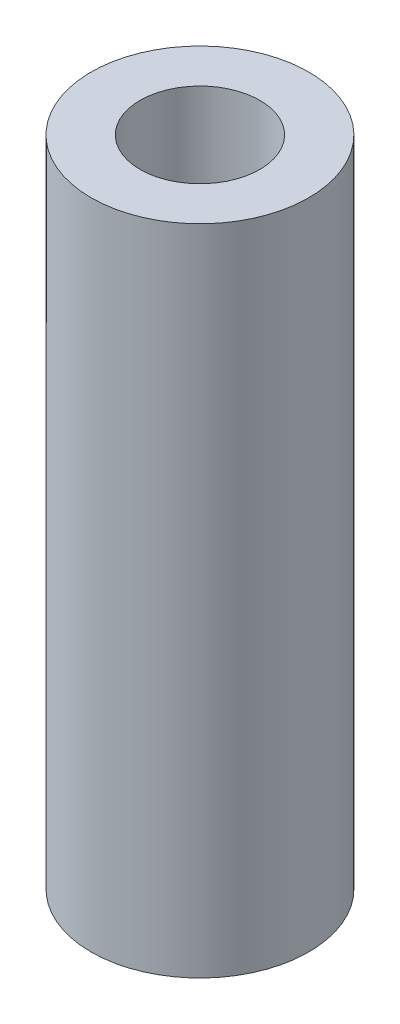
ISO-10303-21;
HEADER;
FILE_DESCRIPTION(('STEP AP214'),'2;1');
FILE_NAME('part.step','',(''),(''),'','','');
FILE_SCHEMA(('AUTOMOTIVE_DESIGN { 1 0 10303 214 1 1 1 1 }'));
ENDSEC;
DATA;
#1=APPLICATION_CONTEXT('core data for automotive mechanical design processes');
#2=APPLICATION_PROTOCOL_DEFINITION('international standard','automotive_design',2000,#1);
#3=PRODUCT_CONTEXT('',#1,'mechanical');
#4=PRODUCT('Part','Part','',(#3));
#5=PRODUCT_RELATED_PRODUCT_CATEGORY('part','',(#4));
#6=PRODUCT_DEFINITION_FORMATION('','',#4);
#7=PRODUCT_DEFINITION_CONTEXT('part definition',#1,'design');
#8=PRODUCT_DEFINITION('design','',#6,#7);
#9=PRODUCT_DEFINITION_SHAPE('','',#8);
#10=(LENGTH_UNIT() NAMED_UNIT(*) SI_UNIT(.MILLI.,.METRE.));
#11=(NAMED_UNIT(*) PLANE_ANGLE_UNIT() SI_UNIT($,.RADIAN.));
#12=(NAMED_UNIT(*) SI_UNIT($,.STERADIAN.) SOLID_ANGLE_UNIT());
#13=UNCERTAINTY_MEASURE_WITH_UNIT(LENGTH_MEASURE(1.E-05),#10,'distance_accuracy_value','');
#14=(GEOMETRIC_REPRESENTATION_CONTEXT(3) GLOBAL_UNCERTAINTY_ASSIGNED_CONTEXT((#13)) GLOBAL_UNIT_ASSIGNED_CONTEXT((#10,
#11,#12)) REPRESENTATION_CONTEXT('',''));
#15=CARTESIAN_POINT('',(0.,0.,0.));
#16=DIRECTION('',(0.,0.,1.));
#17=DIRECTION('',(1.,0.,0.));
#18=AXIS2_PLACEMENT_3D('',#15,#16,#17);
#19=CARTESIAN_POINT('',(0.,60.,0.));
#20=DIRECTION('',(0.,1.,0.));
#21=DIRECTION('',(0.,0.,1.));
#22=AXIS2_PLACEMENT_3D('',#19,#20,#21);
#23=PLANE('',#22);
#24=CARTESIAN_POINT('',(0.,60.,0.));
#25=DIRECTION('',(0.,1.,0.));
#26=DIRECTION('',(0.,0.,1.));
#27=AXIS2_PLACEMENT_3D('',#24,#25,#26);
#28=CIRCLE('',#27,10.);
#29=CARTESIAN_POINT('',(0.,60.,10.));
#30=VERTEX_POINT('',#29);
#31=EDGE_CURVE('E37',#30,#30,#28,.T.);
#32=ORIENTED_EDGE('',*,*,#31,.T.);
#33=EDGE_LOOP('',(#32));
#34=FACE_BOUND('',#33,.T.);
#35=CARTESIAN_POINT('',(0.,60.,0.));
#36=DIRECTION('',(0.,1.,0.));
#37=DIRECTION('',(0.,0.,1.));
#38=AXIS2_PLACEMENT_3D('',#35,#36,#37);
#39=CIRCLE('',#38,5.5);
#40=CARTESIAN_POINT('',(0.,60.,5.5));
#41=VERTEX_POINT('',#40);
#42=EDGE_CURVE('E46',#41,#41,#39,.T.);
#43=ORIENTED_EDGE('',*,*,#42,.F.);
#44=EDGE_LOOP('',(#43));
#45=FACE_BOUND('',#44,.T.);
#46=ADVANCED_FACE('F30',(#34,#45),#23,.T.);
#47=CARTESIAN_POINT('',(0.,0.,0.));
#48=DIRECTION('',(0.,1.,0.));
#49=DIRECTION('',(0.,0.,1.));
#50=AXIS2_PLACEMENT_3D('',#47,#48,#49);
#51=PLANE('',#50);
#52=CARTESIAN_POINT('',(0.,0.,0.));
#53=DIRECTION('',(0.,1.,0.));
#54=DIRECTION('',(0.,0.,1.));
#55=AXIS2_PLACEMENT_3D('',#52,#53,#54);
#56=CIRCLE('',#55,10.);
#57=CARTESIAN_POINT('',(0.,0.,10.));
#58=VERTEX_POINT('',#57);
#59=EDGE_CURVE('E41',#58,#58,#56,.T.);
#60=ORIENTED_EDGE('',*,*,#59,.F.);
#61=EDGE_LOOP('',(#60));
#62=FACE_BOUND('',#61,.T.);
#63=ADVANCED_FACE('F54',(#62),#51,.F.);
#64=CARTESIAN_POINT('',(0.,60.,0.));
#65=DIRECTION('',(0.,-1.,0.));
#66=DIRECTION('',(0.,0.,-1.));
#67=AXIS2_PLACEMENT_3D('',#64,#65,#66);
#68=CYLINDRICAL_SURFACE('',#67,10.);
#69=ORIENTED_EDGE('',*,*,#31,.F.);
#70=EDGE_LOOP('',(#69));
#71=FACE_BOUND('',#70,.T.);
#72=ORIENTED_EDGE('',*,*,#59,.T.);
#73=EDGE_LOOP('',(#72));
#74=FACE_BOUND('',#73,.T.);
#75=ADVANCED_FACE('F32',(#71,#74),#68,.T.);
#76=CARTESIAN_POINT('',(0.,60.,0.));
#77=DIRECTION('',(0.,-1.,0.));
#78=DIRECTION('',(0.,0.,-1.));
#79=AXIS2_PLACEMENT_3D('',#76,#77,#78);
#80=CYLINDRICAL_SURFACE('',#79,5.5);
#81=CARTESIAN_POINT('',(0.,10.,0.));
#82=DIRECTION('',(0.,1.,0.));
#83=DIRECTION('',(0.,0.,1.));
#84=AXIS2_PLACEMENT_3D('',#81,#82,#83);
#85=CIRCLE('',#84,5.5);
#86=CARTESIAN_POINT('',(0.,10.,5.5));
#87=VERTEX_POINT('',#86);
#88=EDGE_CURVE('E10',#87,#87,#85,.T.);
#89=ORIENTED_EDGE('',*,*,#88,.F.);
#90=EDGE_LOOP('',(#89));
#91=FACE_BOUND('',#90,.T.);
#92=ORIENTED_EDGE('',*,*,#42,.T.);
#93=EDGE_LOOP('',(#92));
#94=FACE_BOUND('',#93,.T.);
#95=ADVANCED_FACE('F51',(#91,#94),#80,.F.);
#96=CARTESIAN_POINT('',(0.,10.,0.));
#97=DIRECTION('',(0.,1.,0.));
#98=DIRECTION('',(0.,0.,1.));
#99=AXIS2_PLACEMENT_3D('',#96,#97,#98);
#100=PLANE('',#99);
#101=ORIENTED_EDGE('',*,*,#88,.T.);
#102=EDGE_LOOP('',(#101));
#103=FACE_BOUND('',#102,.T.);
#104=ADVANCED_FACE('F63',(#103),#100,.T.);
#105=CLOSED_SHELL('',(#46,#63,#75,#95,#104));
#106=MANIFOLD_SOLID_BREP('B2',#105);
#107=ADVANCED_BREP_SHAPE_REPRESENTATION('',(#18,#106),#14);
#108=SHAPE_DEFINITION_REPRESENTATION(#9,#107);
ENDSEC;
END-ISO-10303-21;
